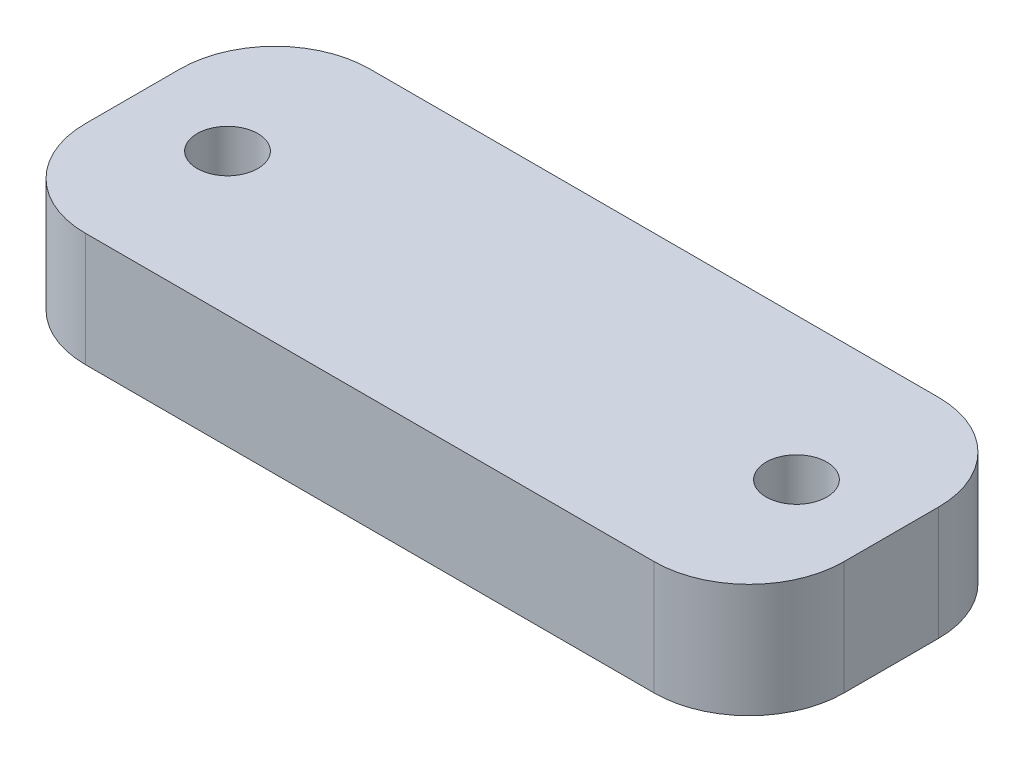
ISO-10303-21;
HEADER;
FILE_DESCRIPTION(('STEP AP214'),'2;1');
FILE_NAME('part.step','',(''),(''),'','','');
FILE_SCHEMA(('AUTOMOTIVE_DESIGN { 1 0 10303 214 1 1 1 1 }'));
ENDSEC;
DATA;
#1=APPLICATION_CONTEXT('core data for automotive mechanical design processes');
#2=APPLICATION_PROTOCOL_DEFINITION('international standard','automotive_design',2000,#1);
#3=PRODUCT_CONTEXT('',#1,'mechanical');
#4=PRODUCT('Part','Part','',(#3));
#5=PRODUCT_RELATED_PRODUCT_CATEGORY('part','',(#4));
#6=PRODUCT_DEFINITION_FORMATION('','',#4);
#7=PRODUCT_DEFINITION_CONTEXT('part definition',#1,'design');
#8=PRODUCT_DEFINITION('design','',#6,#7);
#9=PRODUCT_DEFINITION_SHAPE('','',#8);
#10=(LENGTH_UNIT() NAMED_UNIT(*) SI_UNIT(.MILLI.,.METRE.));
#11=(NAMED_UNIT(*) PLANE_ANGLE_UNIT() SI_UNIT($,.RADIAN.));
#12=(NAMED_UNIT(*) SI_UNIT($,.STERADIAN.) SOLID_ANGLE_UNIT());
#13=UNCERTAINTY_MEASURE_WITH_UNIT(LENGTH_MEASURE(1.E-05),#10,'distance_accuracy_value','');
#14=(GEOMETRIC_REPRESENTATION_CONTEXT(3) GLOBAL_UNCERTAINTY_ASSIGNED_CONTEXT((#13)) GLOBAL_UNIT_ASSIGNED_CONTEXT((#10,
#11,#12)) REPRESENTATION_CONTEXT('',''));
#15=CARTESIAN_POINT('',(0.,0.,0.));
#16=DIRECTION('',(0.,0.,1.));
#17=DIRECTION('',(1.,0.,0.));
#18=AXIS2_PLACEMENT_3D('',#15,#16,#17);
#19=CARTESIAN_POINT('',(20.,6.,-7.5));
#20=DIRECTION('',(-1.,0.,0.));
#21=DIRECTION('',(0.,0.,1.));
#22=AXIS2_PLACEMENT_3D('',#19,#20,#21);
#23=PLANE('',#22);
#24=DIRECTION('',(0.,0.,-1.));
#25=VECTOR('',#24,1.);
#26=CARTESIAN_POINT('',(20.,6.,-7.5));
#27=LINE('',#26,#25);
#28=CARTESIAN_POINT('',(20.,6.,2.5));
#29=VERTEX_POINT('',#28);
#30=CARTESIAN_POINT('',(20.,6.,-2.5));
#31=VERTEX_POINT('',#30);
#32=EDGE_CURVE('E118',#29,#31,#27,.T.);
#33=ORIENTED_EDGE('',*,*,#32,.F.);
#34=DIRECTION('',(0.,-1.,0.));
#35=VECTOR('',#34,1.);
#36=CARTESIAN_POINT('',(20.,6.,2.5));
#37=LINE('',#36,#35);
#38=CARTESIAN_POINT('',(20.,0.,2.5));
#39=VERTEX_POINT('',#38);
#40=EDGE_CURVE('E103',#29,#39,#37,.T.);
#41=ORIENTED_EDGE('',*,*,#40,.T.);
#42=DIRECTION('',(0.,0.,-1.));
#43=VECTOR('',#42,1.);
#44=CARTESIAN_POINT('',(20.,0.,-7.5));
#45=LINE('',#44,#43);
#46=CARTESIAN_POINT('',(20.,0.,-2.5));
#47=VERTEX_POINT('',#46);
#48=EDGE_CURVE('E115',#39,#47,#45,.T.);
#49=ORIENTED_EDGE('',*,*,#48,.T.);
#50=DIRECTION('',(0.,-1.,0.));
#51=VECTOR('',#50,1.);
#52=CARTESIAN_POINT('',(20.,6.,-2.5));
#53=LINE('',#52,#51);
#54=EDGE_CURVE('E120',#47,#31,#53,.F.);
#55=ORIENTED_EDGE('',*,*,#54,.T.);
#56=EDGE_LOOP('',(#33,#41,#49,#55));
#57=FACE_BOUND('',#56,.T.);
#58=ADVANCED_FACE('F33',(#57),#23,.F.);
#59=CARTESIAN_POINT('',(-20.,6.,-7.5));
#60=DIRECTION('',(0.,0.,1.));
#61=DIRECTION('',(1.,0.,0.));
#62=AXIS2_PLACEMENT_3D('',#59,#60,#61);
#63=PLANE('',#62);
#64=DIRECTION('',(-1.,0.,0.));
#65=VECTOR('',#64,1.);
#66=CARTESIAN_POINT('',(-20.,0.,-7.5));
#67=LINE('',#66,#65);
#68=CARTESIAN_POINT('',(15.,0.,-7.5));
#69=VERTEX_POINT('',#68);
#70=CARTESIAN_POINT('',(-15.,0.,-7.5));
#71=VERTEX_POINT('',#70);
#72=EDGE_CURVE('E125',#69,#71,#67,.T.);
#73=ORIENTED_EDGE('',*,*,#72,.T.);
#74=DIRECTION('',(0.,-1.,0.));
#75=VECTOR('',#74,1.);
#76=CARTESIAN_POINT('',(-15.,6.,-7.5));
#77=LINE('',#76,#75);
#78=CARTESIAN_POINT('',(-15.,6.,-7.5));
#79=VERTEX_POINT('',#78);
#80=EDGE_CURVE('E11',#71,#79,#77,.F.);
#81=ORIENTED_EDGE('',*,*,#80,.T.);
#82=DIRECTION('',(-1.,0.,0.));
#83=VECTOR('',#82,1.);
#84=CARTESIAN_POINT('',(-20.,6.,-7.5));
#85=LINE('',#84,#83);
#86=CARTESIAN_POINT('',(15.,6.,-7.5));
#87=VERTEX_POINT('',#86);
#88=EDGE_CURVE('E164',#87,#79,#85,.T.);
#89=ORIENTED_EDGE('',*,*,#88,.F.);
#90=DIRECTION('',(0.,-1.,0.));
#91=VECTOR('',#90,1.);
#92=CARTESIAN_POINT('',(15.,6.,-7.5));
#93=LINE('',#92,#91);
#94=EDGE_CURVE('E41',#87,#69,#93,.T.);
#95=ORIENTED_EDGE('',*,*,#94,.T.);
#96=EDGE_LOOP('',(#73,#81,#89,#95));
#97=FACE_BOUND('',#96,.T.);
#98=ADVANCED_FACE('F162',(#97),#63,.F.);
#99=CARTESIAN_POINT('',(-20.,6.,-7.5));
#100=DIRECTION('',(1.,0.,0.));
#101=DIRECTION('',(0.,0.,-1.));
#102=AXIS2_PLACEMENT_3D('',#99,#100,#101);
#103=PLANE('',#102);
#104=DIRECTION('',(0.,0.,1.));
#105=VECTOR('',#104,1.);
#106=CARTESIAN_POINT('',(-20.,6.,-7.5));
#107=LINE('',#106,#105);
#108=CARTESIAN_POINT('',(-20.,6.,-2.5));
#109=VERTEX_POINT('',#108);
#110=CARTESIAN_POINT('',(-20.,6.,2.5));
#111=VERTEX_POINT('',#110);
#112=EDGE_CURVE('E172',#109,#111,#107,.T.);
#113=ORIENTED_EDGE('',*,*,#112,.F.);
#114=DIRECTION('',(0.,-1.,0.));
#115=VECTOR('',#114,1.);
#116=CARTESIAN_POINT('',(-20.,6.,-2.5));
#117=LINE('',#116,#115);
#118=CARTESIAN_POINT('',(-20.,0.,-2.5));
#119=VERTEX_POINT('',#118);
#120=EDGE_CURVE('E156',#109,#119,#117,.T.);
#121=ORIENTED_EDGE('',*,*,#120,.T.);
#122=DIRECTION('',(0.,0.,1.));
#123=VECTOR('',#122,1.);
#124=CARTESIAN_POINT('',(-20.,0.,-7.5));
#125=LINE('',#124,#123);
#126=CARTESIAN_POINT('',(-20.,0.,2.5));
#127=VERTEX_POINT('',#126);
#128=EDGE_CURVE('E129',#119,#127,#125,.T.);
#129=ORIENTED_EDGE('',*,*,#128,.T.);
#130=DIRECTION('',(0.,-1.,0.));
#131=VECTOR('',#130,1.);
#132=CARTESIAN_POINT('',(-20.,6.,2.5));
#133=LINE('',#132,#131);
#134=EDGE_CURVE('E48',#127,#111,#133,.F.);
#135=ORIENTED_EDGE('',*,*,#134,.T.);
#136=EDGE_LOOP('',(#113,#121,#129,#135));
#137=FACE_BOUND('',#136,.T.);
#138=ADVANCED_FACE('F171',(#137),#103,.F.);
#139=CARTESIAN_POINT('',(-20.,6.,7.5));
#140=DIRECTION('',(0.,0.,-1.));
#141=DIRECTION('',(-1.,0.,0.));
#142=AXIS2_PLACEMENT_3D('',#139,#140,#141);
#143=PLANE('',#142);
#144=DIRECTION('',(1.,0.,0.));
#145=VECTOR('',#144,1.);
#146=CARTESIAN_POINT('',(-20.,0.,7.5));
#147=LINE('',#146,#145);
#148=CARTESIAN_POINT('',(-15.,0.,7.5));
#149=VERTEX_POINT('',#148);
#150=CARTESIAN_POINT('',(15.,0.,7.5));
#151=VERTEX_POINT('',#150);
#152=EDGE_CURVE('E139',#149,#151,#147,.T.);
#153=ORIENTED_EDGE('',*,*,#152,.T.);
#154=DIRECTION('',(0.,-1.,0.));
#155=VECTOR('',#154,1.);
#156=CARTESIAN_POINT('',(15.,6.,7.5));
#157=LINE('',#156,#155);
#158=CARTESIAN_POINT('',(15.,6.,7.5));
#159=VERTEX_POINT('',#158);
#160=EDGE_CURVE('E104',#151,#159,#157,.F.);
#161=ORIENTED_EDGE('',*,*,#160,.T.);
#162=DIRECTION('',(1.,0.,0.));
#163=VECTOR('',#162,1.);
#164=CARTESIAN_POINT('',(-20.,6.,7.5));
#165=LINE('',#164,#163);
#166=CARTESIAN_POINT('',(-15.,6.,7.5));
#167=VERTEX_POINT('',#166);
#168=EDGE_CURVE('E135',#167,#159,#165,.T.);
#169=ORIENTED_EDGE('',*,*,#168,.F.);
#170=DIRECTION('',(0.,-1.,0.));
#171=VECTOR('',#170,1.);
#172=CARTESIAN_POINT('',(-15.,6.,7.5));
#173=LINE('',#172,#171);
#174=EDGE_CURVE('E109',#167,#149,#173,.T.);
#175=ORIENTED_EDGE('',*,*,#174,.T.);
#176=EDGE_LOOP('',(#153,#161,#169,#175));
#177=FACE_BOUND('',#176,.T.);
#178=ADVANCED_FACE('F192',(#177),#143,.F.);
#179=CARTESIAN_POINT('',(0.,6.,0.));
#180=DIRECTION('',(0.,1.,0.));
#181=DIRECTION('',(0.,0.,1.));
#182=AXIS2_PLACEMENT_3D('',#179,#180,#181);
#183=PLANE('',#182);
#184=CARTESIAN_POINT('',(-15.,6.,0.));
#185=DIRECTION('',(0.,1.,0.));
#186=DIRECTION('',(0.,0.,1.));
#187=AXIS2_PLACEMENT_3D('',#184,#185,#186);
#188=CIRCLE('',#187,1.59999999999999);
#189=CARTESIAN_POINT('',(-15.,6.,1.59999999999999));
#190=VERTEX_POINT('',#189);
#191=EDGE_CURVE('E183',#190,#190,#188,.T.);
#192=ORIENTED_EDGE('',*,*,#191,.F.);
#193=EDGE_LOOP('',(#192));
#194=FACE_BOUND('',#193,.T.);
#195=CARTESIAN_POINT('',(15.,6.,0.));
#196=DIRECTION('',(0.,1.,0.));
#197=DIRECTION('',(0.,0.,1.));
#198=AXIS2_PLACEMENT_3D('',#195,#196,#197);
#199=CIRCLE('',#198,1.59999999999999);
#200=CARTESIAN_POINT('',(15.,6.,1.59999999999999));
#201=VERTEX_POINT('',#200);
#202=EDGE_CURVE('E132',#201,#201,#199,.T.);
#203=ORIENTED_EDGE('',*,*,#202,.F.);
#204=EDGE_LOOP('',(#203));
#205=FACE_BOUND('',#204,.T.);
#206=ORIENTED_EDGE('',*,*,#168,.T.);
#207=CARTESIAN_POINT('',(15.,6.,2.5));
#208=DIRECTION('',(0.,1.,0.));
#209=DIRECTION('',(0.,0.,1.));
#210=AXIS2_PLACEMENT_3D('',#207,#208,#209);
#211=CIRCLE('',#210,5.);
#212=EDGE_CURVE('E153',#159,#29,#211,.T.);
#213=ORIENTED_EDGE('',*,*,#212,.T.);
#214=ORIENTED_EDGE('',*,*,#32,.T.);
#215=CARTESIAN_POINT('',(15.,6.,-2.5));
#216=DIRECTION('',(0.,1.,0.));
#217=DIRECTION('',(0.,0.,1.));
#218=AXIS2_PLACEMENT_3D('',#215,#216,#217);
#219=CIRCLE('',#218,5.);
#220=EDGE_CURVE('E150',#31,#87,#219,.T.);
#221=ORIENTED_EDGE('',*,*,#220,.T.);
#222=ORIENTED_EDGE('',*,*,#88,.T.);
#223=CARTESIAN_POINT('',(-15.,6.,-2.5));
#224=DIRECTION('',(0.,1.,0.));
#225=DIRECTION('',(0.,0.,1.));
#226=AXIS2_PLACEMENT_3D('',#223,#224,#225);
#227=CIRCLE('',#226,5.);
#228=EDGE_CURVE('E55',#79,#109,#227,.T.);
#229=ORIENTED_EDGE('',*,*,#228,.T.);
#230=ORIENTED_EDGE('',*,*,#112,.T.);
#231=CARTESIAN_POINT('',(-15.,6.,2.5));
#232=DIRECTION('',(0.,1.,0.));
#233=DIRECTION('',(0.,0.,1.));
#234=AXIS2_PLACEMENT_3D('',#231,#232,#233);
#235=CIRCLE('',#234,5.);
#236=EDGE_CURVE('E148',#111,#167,#235,.T.);
#237=ORIENTED_EDGE('',*,*,#236,.T.);
#238=EDGE_LOOP('',(#206,#213,#214,#221,#222,#229,#230,#237));
#239=FACE_BOUND('',#238,.T.);
#240=ADVANCED_FACE('F189',(#194,#205,#239),#183,.T.);
#241=CARTESIAN_POINT('',(0.,0.,0.));
#242=DIRECTION('',(0.,1.,0.));
#243=DIRECTION('',(0.,0.,1.));
#244=AXIS2_PLACEMENT_3D('',#241,#242,#243);
#245=PLANE('',#244);
#246=CARTESIAN_POINT('',(-15.,0.,0.));
#247=DIRECTION('',(0.,1.,0.));
#248=DIRECTION('',(0.,0.,1.));
#249=AXIS2_PLACEMENT_3D('',#246,#247,#248);
#250=CIRCLE('',#249,1.59999999999999);
#251=CARTESIAN_POINT('',(-15.,0.,1.59999999999999));
#252=VERTEX_POINT('',#251);
#253=EDGE_CURVE('E180',#252,#252,#250,.T.);
#254=ORIENTED_EDGE('',*,*,#253,.T.);
#255=EDGE_LOOP('',(#254));
#256=FACE_BOUND('',#255,.T.);
#257=CARTESIAN_POINT('',(15.,0.,0.));
#258=DIRECTION('',(0.,1.,0.));
#259=DIRECTION('',(0.,0.,1.));
#260=AXIS2_PLACEMENT_3D('',#257,#258,#259);
#261=CIRCLE('',#260,1.59999999999999);
#262=CARTESIAN_POINT('',(15.,0.,1.59999999999999));
#263=VERTEX_POINT('',#262);
#264=EDGE_CURVE('E126',#263,#263,#261,.T.);
#265=ORIENTED_EDGE('',*,*,#264,.T.);
#266=EDGE_LOOP('',(#265));
#267=FACE_BOUND('',#266,.T.);
#268=ORIENTED_EDGE('',*,*,#48,.F.);
#269=CARTESIAN_POINT('',(15.,0.,2.5));
#270=DIRECTION('',(0.,1.,0.));
#271=DIRECTION('',(0.,0.,1.));
#272=AXIS2_PLACEMENT_3D('',#269,#270,#271);
#273=CIRCLE('',#272,5.);
#274=EDGE_CURVE('E99',#39,#151,#273,.F.);
#275=ORIENTED_EDGE('',*,*,#274,.T.);
#276=ORIENTED_EDGE('',*,*,#152,.F.);
#277=CARTESIAN_POINT('',(-15.,0.,2.5));
#278=DIRECTION('',(0.,1.,0.));
#279=DIRECTION('',(0.,0.,1.));
#280=AXIS2_PLACEMENT_3D('',#277,#278,#279);
#281=CIRCLE('',#280,5.);
#282=EDGE_CURVE('E119',#149,#127,#281,.F.);
#283=ORIENTED_EDGE('',*,*,#282,.T.);
#284=ORIENTED_EDGE('',*,*,#128,.F.);
#285=CARTESIAN_POINT('',(-15.,0.,-2.5));
#286=DIRECTION('',(0.,1.,0.));
#287=DIRECTION('',(0.,0.,1.));
#288=AXIS2_PLACEMENT_3D('',#285,#286,#287);
#289=CIRCLE('',#288,5.);
#290=EDGE_CURVE('E110',#119,#71,#289,.F.);
#291=ORIENTED_EDGE('',*,*,#290,.T.);
#292=ORIENTED_EDGE('',*,*,#72,.F.);
#293=CARTESIAN_POINT('',(15.,0.,-2.5));
#294=DIRECTION('',(0.,1.,0.));
#295=DIRECTION('',(0.,0.,1.));
#296=AXIS2_PLACEMENT_3D('',#293,#294,#295);
#297=CIRCLE('',#296,5.);
#298=EDGE_CURVE('E124',#69,#47,#297,.F.);
#299=ORIENTED_EDGE('',*,*,#298,.T.);
#300=EDGE_LOOP('',(#268,#275,#276,#283,#284,#291,#292,#299));
#301=FACE_BOUND('',#300,.T.);
#302=ADVANCED_FACE('F122',(#256,#267,#301),#245,.F.);
#303=CARTESIAN_POINT('',(15.,6.,0.));
#304=DIRECTION('',(0.,1.,0.));
#305=DIRECTION('',(0.,0.,1.));
#306=AXIS2_PLACEMENT_3D('',#303,#304,#305);
#307=CYLINDRICAL_SURFACE('',#306,1.59999999999999);
#308=ORIENTED_EDGE('',*,*,#264,.F.);
#309=EDGE_LOOP('',(#308));
#310=FACE_BOUND('',#309,.T.);
#311=ORIENTED_EDGE('',*,*,#202,.T.);
#312=EDGE_LOOP('',(#311));
#313=FACE_BOUND('',#312,.T.);
#314=ADVANCED_FACE('F244',(#310,#313),#307,.F.);
#315=CARTESIAN_POINT('',(-15.,6.,0.));
#316=DIRECTION('',(0.,1.,0.));
#317=DIRECTION('',(0.,0.,1.));
#318=AXIS2_PLACEMENT_3D('',#315,#316,#317);
#319=CYLINDRICAL_SURFACE('',#318,1.59999999999999);
#320=ORIENTED_EDGE('',*,*,#253,.F.);
#321=EDGE_LOOP('',(#320));
#322=FACE_BOUND('',#321,.T.);
#323=ORIENTED_EDGE('',*,*,#191,.T.);
#324=EDGE_LOOP('',(#323));
#325=FACE_BOUND('',#324,.T.);
#326=ADVANCED_FACE('F187',(#322,#325),#319,.F.);
#327=CARTESIAN_POINT('',(15.,6.,2.5));
#328=DIRECTION('',(0.,-1.,0.));
#329=DIRECTION('',(0.,0.,-1.));
#330=AXIS2_PLACEMENT_3D('',#327,#328,#329);
#331=CYLINDRICAL_SURFACE('',#330,5.);
#332=ORIENTED_EDGE('',*,*,#212,.F.);
#333=ORIENTED_EDGE('',*,*,#160,.F.);
#334=ORIENTED_EDGE('',*,*,#274,.F.);
#335=ORIENTED_EDGE('',*,*,#40,.F.);
#336=EDGE_LOOP('',(#332,#333,#334,#335));
#337=FACE_BOUND('',#336,.T.);
#338=ADVANCED_FACE('F102',(#337),#331,.T.);
#339=CARTESIAN_POINT('',(-15.,6.,-2.5));
#340=DIRECTION('',(0.,-1.,0.));
#341=DIRECTION('',(0.,0.,-1.));
#342=AXIS2_PLACEMENT_3D('',#339,#340,#341);
#343=CYLINDRICAL_SURFACE('',#342,5.);
#344=ORIENTED_EDGE('',*,*,#228,.F.);
#345=ORIENTED_EDGE('',*,*,#80,.F.);
#346=ORIENTED_EDGE('',*,*,#290,.F.);
#347=ORIENTED_EDGE('',*,*,#120,.F.);
#348=EDGE_LOOP('',(#344,#345,#346,#347));
#349=FACE_BOUND('',#348,.T.);
#350=ADVANCED_FACE('F170',(#349),#343,.T.);
#351=CARTESIAN_POINT('',(15.,6.,-2.5));
#352=DIRECTION('',(0.,-1.,0.));
#353=DIRECTION('',(0.,0.,-1.));
#354=AXIS2_PLACEMENT_3D('',#351,#352,#353);
#355=CYLINDRICAL_SURFACE('',#354,5.);
#356=ORIENTED_EDGE('',*,*,#220,.F.);
#357=ORIENTED_EDGE('',*,*,#54,.F.);
#358=ORIENTED_EDGE('',*,*,#298,.F.);
#359=ORIENTED_EDGE('',*,*,#94,.F.);
#360=EDGE_LOOP('',(#356,#357,#358,#359));
#361=FACE_BOUND('',#360,.T.);
#362=ADVANCED_FACE('F200',(#361),#355,.T.);
#363=CARTESIAN_POINT('',(-15.,6.,2.5));
#364=DIRECTION('',(0.,-1.,0.));
#365=DIRECTION('',(0.,0.,-1.));
#366=AXIS2_PLACEMENT_3D('',#363,#364,#365);
#367=CYLINDRICAL_SURFACE('',#366,5.);
#368=ORIENTED_EDGE('',*,*,#236,.F.);
#369=ORIENTED_EDGE('',*,*,#134,.F.);
#370=ORIENTED_EDGE('',*,*,#282,.F.);
#371=ORIENTED_EDGE('',*,*,#174,.F.);
#372=EDGE_LOOP('',(#368,#369,#370,#371));
#373=FACE_BOUND('',#372,.T.);
#374=ADVANCED_FACE('F35',(#373),#367,.T.);
#375=CLOSED_SHELL('',(#58,#98,#138,#178,#240,#302,#314,#326,#338,#350,#362,#374));
#376=MANIFOLD_SOLID_BREP('B2',#375);
#377=ADVANCED_BREP_SHAPE_REPRESENTATION('',(#18,#376),#14);
#378=SHAPE_DEFINITION_REPRESENTATION(#9,#377);
ENDSEC;
END-ISO-10303-21;
